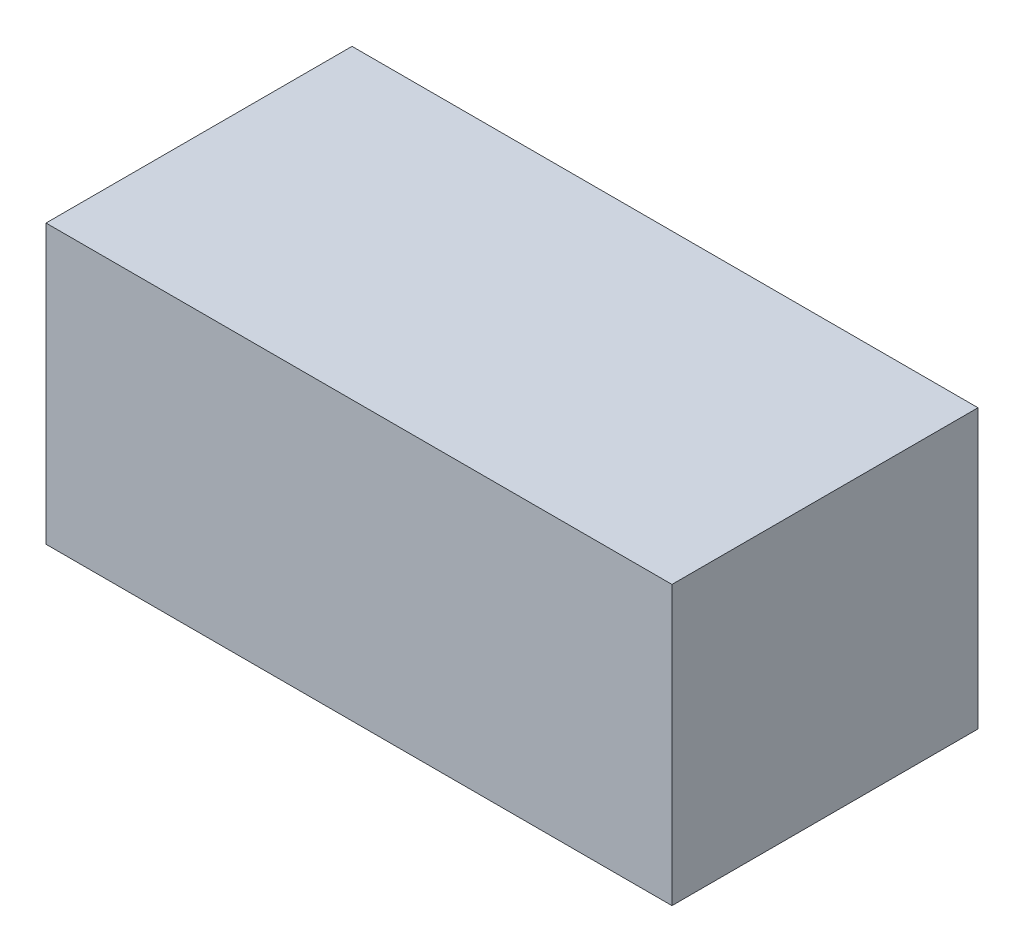
ISO-10303-21;
HEADER;
FILE_DESCRIPTION(('STEP AP214'),'2;1');
FILE_NAME('part.step','',(''),(''),'','','');
FILE_SCHEMA(('AUTOMOTIVE_DESIGN { 1 0 10303 214 1 1 1 1 }'));
ENDSEC;
DATA;
#1=APPLICATION_CONTEXT('core data for automotive mechanical design processes');
#2=APPLICATION_PROTOCOL_DEFINITION('international standard','automotive_design',2000,#1);
#3=PRODUCT_CONTEXT('',#1,'mechanical');
#4=PRODUCT('Part','Part','',(#3));
#5=PRODUCT_RELATED_PRODUCT_CATEGORY('part','',(#4));
#6=PRODUCT_DEFINITION_FORMATION('','',#4);
#7=PRODUCT_DEFINITION_CONTEXT('part definition',#1,'design');
#8=PRODUCT_DEFINITION('design','',#6,#7);
#9=PRODUCT_DEFINITION_SHAPE('','',#8);
#10=(LENGTH_UNIT() NAMED_UNIT(*) SI_UNIT(.MILLI.,.METRE.));
#11=(NAMED_UNIT(*) PLANE_ANGLE_UNIT() SI_UNIT($,.RADIAN.));
#12=(NAMED_UNIT(*) SI_UNIT($,.STERADIAN.) SOLID_ANGLE_UNIT());
#13=UNCERTAINTY_MEASURE_WITH_UNIT(LENGTH_MEASURE(1.E-05),#10,'distance_accuracy_value','');
#14=(GEOMETRIC_REPRESENTATION_CONTEXT(3) GLOBAL_UNCERTAINTY_ASSIGNED_CONTEXT((#13)) GLOBAL_UNIT_ASSIGNED_CONTEXT((#10,
#11,#12)) REPRESENTATION_CONTEXT('',''));
#15=CARTESIAN_POINT('',(0.,0.,0.));
#16=DIRECTION('',(0.,0.,1.));
#17=DIRECTION('',(1.,0.,0.));
#18=AXIS2_PLACEMENT_3D('',#15,#16,#17);
#19=CARTESIAN_POINT('',(-23.1760752337799,20.,-9.49477551768767));
#20=DIRECTION('',(1.,0.,0.));
#21=DIRECTION('',(0.,0.,-1.));
#22=AXIS2_PLACEMENT_3D('',#19,#20,#21);
#23=PLANE('',#22);
#24=DIRECTION('',(0.,0.,1.));
#25=VECTOR('',#24,1.);
#26=CARTESIAN_POINT('',(-23.1760752337799,0.,-9.49477551768767));
#27=LINE('',#26,#25);
#28=CARTESIAN_POINT('',(-23.1760752337799,0.,-9.49477551768767));
#29=VERTEX_POINT('',#28);
#30=CARTESIAN_POINT('',(-23.1760752337799,0.,12.5052244823123));
#31=VERTEX_POINT('',#30);
#32=EDGE_CURVE('E141',#29,#31,#27,.T.);
#33=ORIENTED_EDGE('',*,*,#32,.T.);
#34=DIRECTION('',(0.,-1.,0.));
#35=VECTOR('',#34,1.);
#36=CARTESIAN_POINT('',(-23.1760752337799,20.,12.5052244823123));
#37=LINE('',#36,#35);
#38=CARTESIAN_POINT('',(-23.1760752337799,20.,12.5052244823123));
#39=VERTEX_POINT('',#38);
#40=EDGE_CURVE('E11',#39,#31,#37,.T.);
#41=ORIENTED_EDGE('',*,*,#40,.F.);
#42=DIRECTION('',(0.,0.,1.));
#43=VECTOR('',#42,1.);
#44=CARTESIAN_POINT('',(-23.1760752337799,20.,-9.49477551768767));
#45=LINE('',#44,#43);
#46=CARTESIAN_POINT('',(-23.1760752337799,20.,-9.49477551768767));
#47=VERTEX_POINT('',#46);
#48=EDGE_CURVE('E145',#47,#39,#45,.T.);
#49=ORIENTED_EDGE('',*,*,#48,.F.);
#50=DIRECTION('',(0.,-1.,0.));
#51=VECTOR('',#50,1.);
#52=CARTESIAN_POINT('',(-23.1760752337799,20.,-9.49477551768767));
#53=LINE('',#52,#51);
#54=EDGE_CURVE('E151',#47,#29,#53,.T.);
#55=ORIENTED_EDGE('',*,*,#54,.T.);
#56=EDGE_LOOP('',(#33,#41,#49,#55));
#57=FACE_BOUND('',#56,.T.);
#58=ADVANCED_FACE('F33',(#57),#23,.F.);
#59=CARTESIAN_POINT('',(-23.1760752337799,20.,12.5052244823123));
#60=DIRECTION('',(0.,0.,-1.));
#61=DIRECTION('',(-1.,0.,0.));
#62=AXIS2_PLACEMENT_3D('',#59,#60,#61);
#63=PLANE('',#62);
#64=DIRECTION('',(1.,0.,0.));
#65=VECTOR('',#64,1.);
#66=CARTESIAN_POINT('',(-23.1760752337799,0.,12.5052244823123));
#67=LINE('',#66,#65);
#68=CARTESIAN_POINT('',(21.8239247662201,0.,12.5052244823123));
#69=VERTEX_POINT('',#68);
#70=EDGE_CURVE('E154',#31,#69,#67,.T.);
#71=ORIENTED_EDGE('',*,*,#70,.T.);
#72=DIRECTION('',(0.,-1.,0.));
#73=VECTOR('',#72,1.);
#74=CARTESIAN_POINT('',(21.8239247662201,20.,12.5052244823123));
#75=LINE('',#74,#73);
#76=CARTESIAN_POINT('',(21.8239247662201,20.,12.5052244823123));
#77=VERTEX_POINT('',#76);
#78=EDGE_CURVE('E40',#77,#69,#75,.T.);
#79=ORIENTED_EDGE('',*,*,#78,.F.);
#80=DIRECTION('',(1.,0.,0.));
#81=VECTOR('',#80,1.);
#82=CARTESIAN_POINT('',(-23.1760752337799,20.,12.5052244823123));
#83=LINE('',#82,#81);
#84=EDGE_CURVE('E84',#39,#77,#83,.T.);
#85=ORIENTED_EDGE('',*,*,#84,.F.);
#86=ORIENTED_EDGE('',*,*,#40,.T.);
#87=EDGE_LOOP('',(#71,#79,#85,#86));
#88=FACE_BOUND('',#87,.T.);
#89=ADVANCED_FACE('F182',(#88),#63,.F.);
#90=CARTESIAN_POINT('',(21.8239247662201,20.,-9.49477551768767));
#91=DIRECTION('',(-1.,0.,0.));
#92=DIRECTION('',(0.,0.,1.));
#93=AXIS2_PLACEMENT_3D('',#90,#91,#92);
#94=PLANE('',#93);
#95=DIRECTION('',(0.,0.,-1.));
#96=VECTOR('',#95,1.);
#97=CARTESIAN_POINT('',(21.8239247662201,0.,-9.49477551768767));
#98=LINE('',#97,#96);
#99=CARTESIAN_POINT('',(21.8239247662201,0.,-9.49477551768767));
#100=VERTEX_POINT('',#99);
#101=EDGE_CURVE('E156',#69,#100,#98,.T.);
#102=ORIENTED_EDGE('',*,*,#101,.T.);
#103=DIRECTION('',(0.,-1.,0.));
#104=VECTOR('',#103,1.);
#105=CARTESIAN_POINT('',(21.8239247662201,20.,-9.49477551768767));
#106=LINE('',#105,#104);
#107=CARTESIAN_POINT('',(21.8239247662201,20.,-9.49477551768767));
#108=VERTEX_POINT('',#107);
#109=EDGE_CURVE('E160',#108,#100,#106,.T.);
#110=ORIENTED_EDGE('',*,*,#109,.F.);
#111=DIRECTION('',(0.,0.,-1.));
#112=VECTOR('',#111,1.);
#113=CARTESIAN_POINT('',(21.8239247662201,20.,-9.49477551768767));
#114=LINE('',#113,#112);
#115=EDGE_CURVE('E148',#77,#108,#114,.T.);
#116=ORIENTED_EDGE('',*,*,#115,.F.);
#117=ORIENTED_EDGE('',*,*,#78,.T.);
#118=EDGE_LOOP('',(#102,#110,#116,#117));
#119=FACE_BOUND('',#118,.T.);
#120=ADVANCED_FACE('F165',(#119),#94,.F.);
#121=CARTESIAN_POINT('',(-23.1760752337799,20.,-9.49477551768767));
#122=DIRECTION('',(0.,0.,1.));
#123=DIRECTION('',(1.,0.,0.));
#124=AXIS2_PLACEMENT_3D('',#121,#122,#123);
#125=PLANE('',#124);
#126=DIRECTION('',(-1.,0.,0.));
#127=VECTOR('',#126,1.);
#128=CARTESIAN_POINT('',(-23.1760752337799,0.,-9.49477551768767));
#129=LINE('',#128,#127);
#130=EDGE_CURVE('E77',#100,#29,#129,.T.);
#131=ORIENTED_EDGE('',*,*,#130,.T.);
#132=ORIENTED_EDGE('',*,*,#54,.F.);
#133=DIRECTION('',(-1.,0.,0.));
#134=VECTOR('',#133,1.);
#135=CARTESIAN_POINT('',(-23.1760752337799,20.,-9.49477551768767));
#136=LINE('',#135,#134);
#137=EDGE_CURVE('E56',#108,#47,#136,.T.);
#138=ORIENTED_EDGE('',*,*,#137,.F.);
#139=ORIENTED_EDGE('',*,*,#109,.T.);
#140=EDGE_LOOP('',(#131,#132,#138,#139));
#141=FACE_BOUND('',#140,.T.);
#142=ADVANCED_FACE('F173',(#141),#125,.F.);
#143=CARTESIAN_POINT('',(0.,20.,0.));
#144=DIRECTION('',(0.,1.,0.));
#145=DIRECTION('',(0.,0.,1.));
#146=AXIS2_PLACEMENT_3D('',#143,#144,#145);
#147=PLANE('',#146);
#148=ORIENTED_EDGE('',*,*,#48,.T.);
#149=ORIENTED_EDGE('',*,*,#84,.T.);
#150=ORIENTED_EDGE('',*,*,#115,.T.);
#151=ORIENTED_EDGE('',*,*,#137,.T.);
#152=EDGE_LOOP('',(#148,#149,#150,#151));
#153=FACE_BOUND('',#152,.T.);
#154=ADVANCED_FACE('F175',(#153),#147,.T.);
#155=CARTESIAN_POINT('',(0.,0.,0.));
#156=DIRECTION('',(0.,1.,0.));
#157=DIRECTION('',(0.,0.,1.));
#158=AXIS2_PLACEMENT_3D('',#155,#156,#157);
#159=PLANE('',#158);
#160=DIRECTION('',(1.,0.,0.));
#161=VECTOR('',#160,1.);
#162=CARTESIAN_POINT('',(-22.6760752337799,0.,-8.99477551768767));
#163=LINE('',#162,#161);
#164=CARTESIAN_POINT('',(-22.6760752337799,0.,-8.99477551768767));
#165=VERTEX_POINT('',#164);
#166=CARTESIAN_POINT('',(21.3239247662201,0.,-8.99477551768767));
#167=VERTEX_POINT('',#166);
#168=EDGE_CURVE('E135',#165,#167,#163,.T.);
#169=ORIENTED_EDGE('',*,*,#168,.F.);
#170=DIRECTION('',(0.,0.,-1.));
#171=VECTOR('',#170,1.);
#172=CARTESIAN_POINT('',(-22.6760752337799,0.,12.0052244823123));
#173=LINE('',#172,#171);
#174=CARTESIAN_POINT('',(-22.6760752337799,0.,12.0052244823123));
#175=VERTEX_POINT('',#174);
#176=EDGE_CURVE('E47',#175,#165,#173,.T.);
#177=ORIENTED_EDGE('',*,*,#176,.F.);
#178=DIRECTION('',(-1.,0.,0.));
#179=VECTOR('',#178,1.);
#180=CARTESIAN_POINT('',(-22.6760752337799,0.,12.0052244823123));
#181=LINE('',#180,#179);
#182=CARTESIAN_POINT('',(21.3239247662201,0.,12.0052244823123));
#183=VERTEX_POINT('',#182);
#184=EDGE_CURVE('E126',#183,#175,#181,.T.);
#185=ORIENTED_EDGE('',*,*,#184,.F.);
#186=DIRECTION('',(0.,0.,1.));
#187=VECTOR('',#186,1.);
#188=CARTESIAN_POINT('',(21.3239247662201,0.,12.0052244823123));
#189=LINE('',#188,#187);
#190=EDGE_CURVE('E129',#167,#183,#189,.T.);
#191=ORIENTED_EDGE('',*,*,#190,.F.);
#192=EDGE_LOOP('',(#169,#177,#185,#191));
#193=FACE_BOUND('',#192,.T.);
#194=ORIENTED_EDGE('',*,*,#32,.F.);
#195=ORIENTED_EDGE('',*,*,#130,.F.);
#196=ORIENTED_EDGE('',*,*,#101,.F.);
#197=ORIENTED_EDGE('',*,*,#70,.F.);
#198=EDGE_LOOP('',(#194,#195,#196,#197));
#199=FACE_BOUND('',#198,.T.);
#200=ADVANCED_FACE('F169',(#193,#199),#159,.F.);
#201=CARTESIAN_POINT('',(-22.6760752337799,18.,12.0052244823123));
#202=DIRECTION('',(-1.,0.,0.));
#203=DIRECTION('',(0.,0.,1.));
#204=AXIS2_PLACEMENT_3D('',#201,#202,#203);
#205=PLANE('',#204);
#206=ORIENTED_EDGE('',*,*,#176,.T.);
#207=DIRECTION('',(0.,-1.,0.));
#208=VECTOR('',#207,1.);
#209=CARTESIAN_POINT('',(-22.6760752337799,18.,-8.99477551768767));
#210=LINE('',#209,#208);
#211=CARTESIAN_POINT('',(-22.6760752337799,18.,-8.99477551768767));
#212=VERTEX_POINT('',#211);
#213=EDGE_CURVE('E104',#212,#165,#210,.T.);
#214=ORIENTED_EDGE('',*,*,#213,.F.);
#215=DIRECTION('',(0.,0.,-1.));
#216=VECTOR('',#215,1.);
#217=CARTESIAN_POINT('',(-22.6760752337799,18.,12.0052244823123));
#218=LINE('',#217,#216);
#219=CARTESIAN_POINT('',(-22.6760752337799,18.,12.0052244823123));
#220=VERTEX_POINT('',#219);
#221=EDGE_CURVE('E108',#220,#212,#218,.T.);
#222=ORIENTED_EDGE('',*,*,#221,.F.);
#223=DIRECTION('',(0.,-1.,0.));
#224=VECTOR('',#223,1.);
#225=CARTESIAN_POINT('',(-22.6760752337799,18.,12.0052244823123));
#226=LINE('',#225,#224);
#227=EDGE_CURVE('E139',#220,#175,#226,.T.);
#228=ORIENTED_EDGE('',*,*,#227,.T.);
#229=EDGE_LOOP('',(#206,#214,#222,#228));
#230=FACE_BOUND('',#229,.T.);
#231=ADVANCED_FACE('F106',(#230),#205,.F.);
#232=CARTESIAN_POINT('',(-22.6760752337799,18.,12.0052244823123));
#233=DIRECTION('',(0.,0.,1.));
#234=DIRECTION('',(1.,0.,0.));
#235=AXIS2_PLACEMENT_3D('',#232,#233,#234);
#236=PLANE('',#235);
#237=ORIENTED_EDGE('',*,*,#184,.T.);
#238=ORIENTED_EDGE('',*,*,#227,.F.);
#239=DIRECTION('',(-1.,0.,0.));
#240=VECTOR('',#239,1.);
#241=CARTESIAN_POINT('',(-22.6760752337799,18.,12.0052244823123));
#242=LINE('',#241,#240);
#243=CARTESIAN_POINT('',(21.3239247662201,18.,12.0052244823123));
#244=VERTEX_POINT('',#243);
#245=EDGE_CURVE('E114',#244,#220,#242,.T.);
#246=ORIENTED_EDGE('',*,*,#245,.F.);
#247=DIRECTION('',(0.,-1.,0.));
#248=VECTOR('',#247,1.);
#249=CARTESIAN_POINT('',(21.3239247662201,18.,12.0052244823123));
#250=LINE('',#249,#248);
#251=EDGE_CURVE('E142',#244,#183,#250,.T.);
#252=ORIENTED_EDGE('',*,*,#251,.T.);
#253=EDGE_LOOP('',(#237,#238,#246,#252));
#254=FACE_BOUND('',#253,.T.);
#255=ADVANCED_FACE('F222',(#254),#236,.F.);
#256=CARTESIAN_POINT('',(21.3239247662201,18.,12.0052244823123));
#257=DIRECTION('',(1.,0.,0.));
#258=DIRECTION('',(0.,0.,-1.));
#259=AXIS2_PLACEMENT_3D('',#256,#257,#258);
#260=PLANE('',#259);
#261=ORIENTED_EDGE('',*,*,#190,.T.);
#262=ORIENTED_EDGE('',*,*,#251,.F.);
#263=DIRECTION('',(0.,0.,1.));
#264=VECTOR('',#263,1.);
#265=CARTESIAN_POINT('',(21.3239247662201,18.,12.0052244823123));
#266=LINE('',#265,#264);
#267=CARTESIAN_POINT('',(21.3239247662201,18.,-8.99477551768767));
#268=VERTEX_POINT('',#267);
#269=EDGE_CURVE('E122',#268,#244,#266,.T.);
#270=ORIENTED_EDGE('',*,*,#269,.F.);
#271=DIRECTION('',(0.,-1.,0.));
#272=VECTOR('',#271,1.);
#273=CARTESIAN_POINT('',(21.3239247662201,18.,-8.99477551768767));
#274=LINE('',#273,#272);
#275=EDGE_CURVE('E113',#268,#167,#274,.T.);
#276=ORIENTED_EDGE('',*,*,#275,.T.);
#277=EDGE_LOOP('',(#261,#262,#270,#276));
#278=FACE_BOUND('',#277,.T.);
#279=ADVANCED_FACE('F231',(#278),#260,.F.);
#280=CARTESIAN_POINT('',(-22.6760752337799,18.,-8.99477551768767));
#281=DIRECTION('',(0.,0.,-1.));
#282=DIRECTION('',(-1.,0.,0.));
#283=AXIS2_PLACEMENT_3D('',#280,#281,#282);
#284=PLANE('',#283);
#285=ORIENTED_EDGE('',*,*,#168,.T.);
#286=ORIENTED_EDGE('',*,*,#275,.F.);
#287=DIRECTION('',(1.,0.,0.));
#288=VECTOR('',#287,1.);
#289=CARTESIAN_POINT('',(-22.6760752337799,18.,-8.99477551768767));
#290=LINE('',#289,#288);
#291=EDGE_CURVE('E117',#212,#268,#290,.T.);
#292=ORIENTED_EDGE('',*,*,#291,.F.);
#293=ORIENTED_EDGE('',*,*,#213,.T.);
#294=EDGE_LOOP('',(#285,#286,#292,#293));
#295=FACE_BOUND('',#294,.T.);
#296=ADVANCED_FACE('F118',(#295),#284,.F.);
#297=CARTESIAN_POINT('',(0.,18.,0.));
#298=DIRECTION('',(0.,-1.,0.));
#299=DIRECTION('',(0.,0.,-1.));
#300=AXIS2_PLACEMENT_3D('',#297,#298,#299);
#301=PLANE('',#300);
#302=ORIENTED_EDGE('',*,*,#221,.T.);
#303=ORIENTED_EDGE('',*,*,#291,.T.);
#304=ORIENTED_EDGE('',*,*,#269,.T.);
#305=ORIENTED_EDGE('',*,*,#245,.T.);
#306=EDGE_LOOP('',(#302,#303,#304,#305));
#307=FACE_BOUND('',#306,.T.);
#308=ADVANCED_FACE('F124',(#307),#301,.T.);
#309=CLOSED_SHELL('',(#58,#89,#120,#142,#154,#200,#231,#255,#279,#296,#308));
#310=MANIFOLD_SOLID_BREP('B2',#309);
#311=ADVANCED_BREP_SHAPE_REPRESENTATION('',(#18,#310),#14);
#312=SHAPE_DEFINITION_REPRESENTATION(#9,#311);
ENDSEC;
END-ISO-10303-21;
